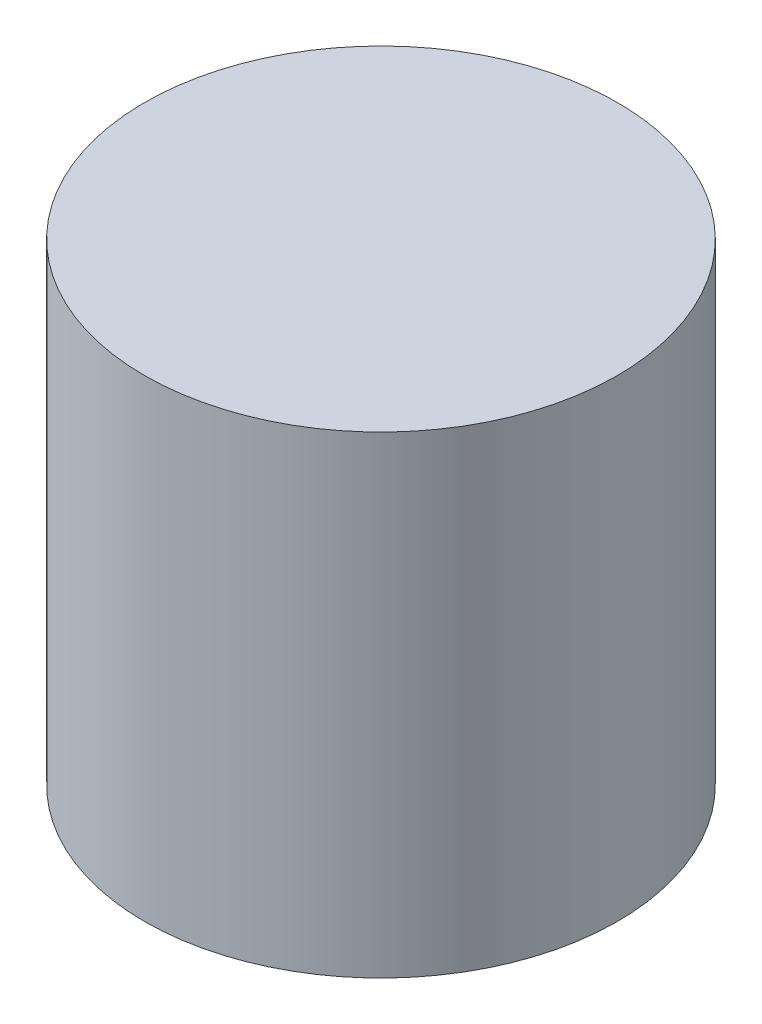
ISO-10303-21;
HEADER;
FILE_DESCRIPTION(('STEP AP214'),'2;1');
FILE_NAME('part.step','',(''),(''),'','','');
FILE_SCHEMA(('AUTOMOTIVE_DESIGN { 1 0 10303 214 1 1 1 1 }'));
ENDSEC;
DATA;
#1=APPLICATION_CONTEXT('core data for automotive mechanical design processes');
#2=APPLICATION_PROTOCOL_DEFINITION('international standard','automotive_design',2000,#1);
#3=PRODUCT_CONTEXT('',#1,'mechanical');
#4=PRODUCT('Part','Part','',(#3));
#5=PRODUCT_RELATED_PRODUCT_CATEGORY('part','',(#4));
#6=PRODUCT_DEFINITION_FORMATION('','',#4);
#7=PRODUCT_DEFINITION_CONTEXT('part definition',#1,'design');
#8=PRODUCT_DEFINITION('design','',#6,#7);
#9=PRODUCT_DEFINITION_SHAPE('','',#8);
#10=(LENGTH_UNIT() NAMED_UNIT(*) SI_UNIT(.MILLI.,.METRE.));
#11=(NAMED_UNIT(*) PLANE_ANGLE_UNIT() SI_UNIT($,.RADIAN.));
#12=(NAMED_UNIT(*) SI_UNIT($,.STERADIAN.) SOLID_ANGLE_UNIT());
#13=UNCERTAINTY_MEASURE_WITH_UNIT(LENGTH_MEASURE(1.E-05),#10,'distance_accuracy_value','');
#14=(GEOMETRIC_REPRESENTATION_CONTEXT(3) GLOBAL_UNCERTAINTY_ASSIGNED_CONTEXT((#13)) GLOBAL_UNIT_ASSIGNED_CONTEXT((#10,
#11,#12)) REPRESENTATION_CONTEXT('',''));
#15=CARTESIAN_POINT('',(0.,0.,0.));
#16=DIRECTION('',(0.,0.,1.));
#17=DIRECTION('',(1.,0.,0.));
#18=AXIS2_PLACEMENT_3D('',#15,#16,#17);
#19=CARTESIAN_POINT('',(0.,3.,0.));
#20=DIRECTION('',(0.,-1.,0.));
#21=DIRECTION('',(0.,0.,-1.));
#22=AXIS2_PLACEMENT_3D('',#19,#20,#21);
#23=CYLINDRICAL_SURFACE('',#22,1.5);
#24=CARTESIAN_POINT('',(0.,3.,0.));
#25=DIRECTION('',(0.,1.,0.));
#26=DIRECTION('',(0.,0.,1.));
#27=AXIS2_PLACEMENT_3D('',#24,#25,#26);
#28=CIRCLE('',#27,1.5);
#29=CARTESIAN_POINT('',(0.,3.,1.5));
#30=VERTEX_POINT('',#29);
#31=EDGE_CURVE('E10',#30,#30,#28,.T.);
#32=ORIENTED_EDGE('',*,*,#31,.F.);
#33=EDGE_LOOP('',(#32));
#34=FACE_BOUND('',#33,.T.);
#35=CARTESIAN_POINT('',(0.,0.,0.));
#36=DIRECTION('',(0.,1.,0.));
#37=DIRECTION('',(0.,0.,1.));
#38=AXIS2_PLACEMENT_3D('',#35,#36,#37);
#39=CIRCLE('',#38,1.5);
#40=CARTESIAN_POINT('',(0.,0.,1.5));
#41=VERTEX_POINT('',#40);
#42=EDGE_CURVE('E40',#41,#41,#39,.T.);
#43=ORIENTED_EDGE('',*,*,#42,.T.);
#44=EDGE_LOOP('',(#43));
#45=FACE_BOUND('',#44,.T.);
#46=ADVANCED_FACE('F37',(#34,#45),#23,.T.);
#47=CARTESIAN_POINT('',(0.,3.,0.));
#48=DIRECTION('',(0.,1.,0.));
#49=DIRECTION('',(0.,0.,1.));
#50=AXIS2_PLACEMENT_3D('',#47,#48,#49);
#51=PLANE('',#50);
#52=ORIENTED_EDGE('',*,*,#31,.T.);
#53=EDGE_LOOP('',(#52));
#54=FACE_BOUND('',#53,.T.);
#55=ADVANCED_FACE('F52',(#54),#51,.T.);
#56=CARTESIAN_POINT('',(0.,0.,0.));
#57=DIRECTION('',(0.,1.,0.));
#58=DIRECTION('',(0.,0.,1.));
#59=AXIS2_PLACEMENT_3D('',#56,#57,#58);
#60=PLANE('',#59);
#61=ORIENTED_EDGE('',*,*,#42,.F.);
#62=EDGE_LOOP('',(#61));
#63=FACE_BOUND('',#62,.T.);
#64=ADVANCED_FACE('F50',(#63),#60,.F.);
#65=CLOSED_SHELL('',(#46,#55,#64));
#66=MANIFOLD_SOLID_BREP('B2',#65);
#67=ADVANCED_BREP_SHAPE_REPRESENTATION('',(#18,#66),#14);
#68=SHAPE_DEFINITION_REPRESENTATION(#9,#67);
ENDSEC;
END-ISO-10303-21;
